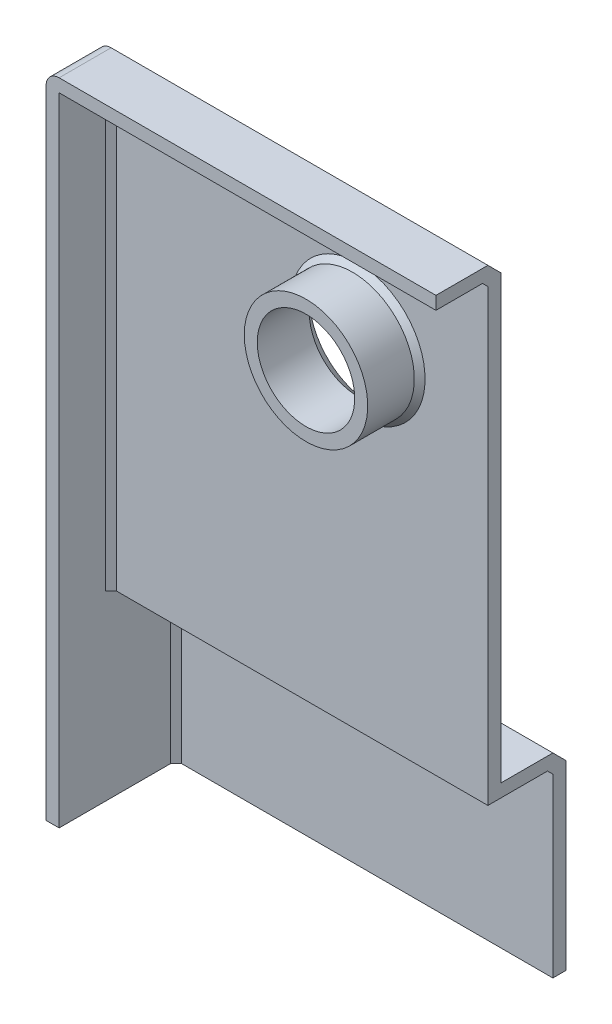
ISO-10303-21;
HEADER;
FILE_DESCRIPTION(('STEP AP214'),'2;1');
FILE_NAME('part.step','',(''),(''),'','','');
FILE_SCHEMA(('AUTOMOTIVE_DESIGN { 1 0 10303 214 1 1 1 1 }'));
ENDSEC;
DATA;
#1=APPLICATION_CONTEXT('core data for automotive mechanical design processes');
#2=APPLICATION_PROTOCOL_DEFINITION('international standard','automotive_design',2000,#1);
#3=PRODUCT_CONTEXT('',#1,'mechanical');
#4=PRODUCT('Part','Part','',(#3));
#5=PRODUCT_RELATED_PRODUCT_CATEGORY('part','',(#4));
#6=PRODUCT_DEFINITION_FORMATION('','',#4);
#7=PRODUCT_DEFINITION_CONTEXT('part definition',#1,'design');
#8=PRODUCT_DEFINITION('design','',#6,#7);
#9=PRODUCT_DEFINITION_SHAPE('','',#8);
#10=(LENGTH_UNIT() NAMED_UNIT(*) SI_UNIT(.MILLI.,.METRE.));
#11=(NAMED_UNIT(*) PLANE_ANGLE_UNIT() SI_UNIT($,.RADIAN.));
#12=(NAMED_UNIT(*) SI_UNIT($,.STERADIAN.) SOLID_ANGLE_UNIT());
#13=UNCERTAINTY_MEASURE_WITH_UNIT(LENGTH_MEASURE(1.E-05),#10,'distance_accuracy_value','');
#14=(GEOMETRIC_REPRESENTATION_CONTEXT(3) GLOBAL_UNCERTAINTY_ASSIGNED_CONTEXT((#13)) GLOBAL_UNIT_ASSIGNED_CONTEXT((#10,
#11,#12)) REPRESENTATION_CONTEXT('',''));
#15=CARTESIAN_POINT('',(0.,0.,0.));
#16=DIRECTION('',(0.,0.,1.));
#17=DIRECTION('',(1.,0.,0.));
#18=AXIS2_PLACEMENT_3D('',#15,#16,#17);
#19=CARTESIAN_POINT('',(0.,0.,12.7));
#20=DIRECTION('',(0.,1.,0.));
#21=DIRECTION('',(0.,0.,1.));
#22=AXIS2_PLACEMENT_3D('',#19,#20,#21);
#23=PLANE('',#22);
#24=DIRECTION('',(0.,0.,-1.));
#25=VECTOR('',#24,1.);
#26=CARTESIAN_POINT('',(2.54,0.,12.7));
#27=LINE('',#26,#25);
#28=CARTESIAN_POINT('',(2.54,0.,12.7));
#29=VERTEX_POINT('',#28);
#30=CARTESIAN_POINT('',(2.54,0.,-9.10789755157235));
#31=VERTEX_POINT('',#30);
#32=EDGE_CURVE('E220',#29,#31,#27,.T.);
#33=ORIENTED_EDGE('',*,*,#32,.F.);
#34=DIRECTION('',(1.,0.,0.));
#35=VECTOR('',#34,1.);
#36=CARTESIAN_POINT('',(0.,0.,12.7));
#37=LINE('',#36,#35);
#38=CARTESIAN_POINT('',(0.,0.,12.7));
#39=VERTEX_POINT('',#38);
#40=EDGE_CURVE('E286',#39,#29,#37,.T.);
#41=ORIENTED_EDGE('',*,*,#40,.F.);
#42=DIRECTION('',(0.,0.,-1.));
#43=VECTOR('',#42,1.);
#44=CARTESIAN_POINT('',(0.,0.,12.7));
#45=LINE('',#44,#43);
#46=CARTESIAN_POINT('',(0.,0.,-10.16));
#47=VERTEX_POINT('',#46);
#48=EDGE_CURVE('E307',#39,#47,#45,.T.);
#49=ORIENTED_EDGE('',*,*,#48,.T.);
#50=DIRECTION('',(-0.707106781186548,0.,0.707106781186548));
#51=VECTOR('',#50,1.);
#52=CARTESIAN_POINT('',(2.53999999999999,0.,-12.7));
#53=LINE('',#52,#51);
#54=CARTESIAN_POINT('',(2.54000000000001,0.,-12.7));
#55=VERTEX_POINT('',#54);
#56=EDGE_CURVE('E368',#47,#55,#53,.F.);
#57=ORIENTED_EDGE('',*,*,#56,.T.);
#58=DIRECTION('',(-1.,0.,0.));
#59=VECTOR('',#58,1.);
#60=CARTESIAN_POINT('',(76.2,0.,-12.7));
#61=LINE('',#60,#59);
#62=CARTESIAN_POINT('',(76.2,0.,-12.7));
#63=VERTEX_POINT('',#62);
#64=EDGE_CURVE('E272',#63,#55,#61,.T.);
#65=ORIENTED_EDGE('',*,*,#64,.F.);
#66=DIRECTION('',(0.,0.,-1.));
#67=VECTOR('',#66,1.);
#68=CARTESIAN_POINT('',(76.2,0.,12.7));
#69=LINE('',#68,#67);
#70=CARTESIAN_POINT('',(76.2,0.,-10.16));
#71=VERTEX_POINT('',#70);
#72=EDGE_CURVE('E304',#71,#63,#69,.T.);
#73=ORIENTED_EDGE('',*,*,#72,.F.);
#74=DIRECTION('',(-1.,0.,0.));
#75=VECTOR('',#74,1.);
#76=CARTESIAN_POINT('',(0.,0.,-10.16));
#77=LINE('',#76,#75);
#78=CARTESIAN_POINT('',(3.59210244842765,0.,-10.16));
#79=VERTEX_POINT('',#78);
#80=EDGE_CURVE('E228',#71,#79,#77,.T.);
#81=ORIENTED_EDGE('',*,*,#80,.T.);
#82=DIRECTION('',(-0.707106781186548,0.,0.707106781186548));
#83=VECTOR('',#82,1.);
#84=CARTESIAN_POINT('',(4.33605122421382,0.,-10.9039487757862));
#85=LINE('',#84,#83);
#86=EDGE_CURVE('E224',#31,#79,#85,.F.);
#87=ORIENTED_EDGE('',*,*,#86,.F.);
#88=EDGE_LOOP('',(#33,#41,#49,#57,#65,#73,#81,#87));
#89=FACE_BOUND('',#88,.T.);
#90=ADVANCED_FACE('F45',(#89),#23,.F.);
#91=CARTESIAN_POINT('',(0.,0.,12.7));
#92=DIRECTION('',(0.,0.,-1.));
#93=DIRECTION('',(-1.,0.,0.));
#94=AXIS2_PLACEMENT_3D('',#91,#92,#93);
#95=PLANE('',#94);
#96=CARTESIAN_POINT('',(50.8,101.6,12.7));
#97=DIRECTION('',(0.,0.,-1.));
#98=DIRECTION('',(-1.,0.,0.));
#99=AXIS2_PLACEMENT_3D('',#96,#97,#98);
#100=CIRCLE('',#99,9.525);
#101=CARTESIAN_POINT('',(41.275,101.6,12.7));
#102=VERTEX_POINT('',#101);
#103=EDGE_CURVE('E262',#102,#102,#100,.T.);
#104=ORIENTED_EDGE('',*,*,#103,.T.);
#105=EDGE_LOOP('',(#104));
#106=FACE_BOUND('',#105,.T.);
#107=CARTESIAN_POINT('',(50.8,101.6,12.7));
#108=DIRECTION('',(0.,0.,-1.));
#109=DIRECTION('',(-1.,0.,0.));
#110=AXIS2_PLACEMENT_3D('',#107,#108,#109);
#111=CIRCLE('',#110,12.065);
#112=CARTESIAN_POINT('',(38.735,101.6,12.7));
#113=VERTEX_POINT('',#112);
#114=EDGE_CURVE('E258',#113,#113,#111,.T.);
#115=ORIENTED_EDGE('',*,*,#114,.F.);
#116=EDGE_LOOP('',(#115));
#117=FACE_BOUND('',#116,.T.);
#118=ADVANCED_FACE('F459',(#106,#117),#95,.F.);
#119=DIRECTION('',(-1.,0.,0.));
#120=VECTOR('',#119,1.);
#121=CARTESIAN_POINT('',(0.,124.46,12.7));
#122=LINE('',#121,#120);
#123=CARTESIAN_POINT('',(76.2,124.46,12.7));
#124=VERTEX_POINT('',#123);
#125=CARTESIAN_POINT('',(2.54,124.46,12.7));
#126=VERTEX_POINT('',#125);
#127=EDGE_CURVE('E64',#124,#126,#122,.T.);
#128=ORIENTED_EDGE('',*,*,#127,.F.);
#129=DIRECTION('',(0.,1.,0.));
#130=VECTOR('',#129,1.);
#131=CARTESIAN_POINT('',(76.2,0.,12.7));
#132=LINE('',#131,#130);
#133=CARTESIAN_POINT('',(76.2,127.,12.7));
#134=VERTEX_POINT('',#133);
#135=EDGE_CURVE('E290',#124,#134,#132,.T.);
#136=ORIENTED_EDGE('',*,*,#135,.T.);
#137=DIRECTION('',(-1.,0.,0.));
#138=VECTOR('',#137,1.);
#139=CARTESIAN_POINT('',(0.,127.,12.7));
#140=LINE('',#139,#138);
#141=CARTESIAN_POINT('',(2.54,127.,12.7));
#142=VERTEX_POINT('',#141);
#143=EDGE_CURVE('E293',#134,#142,#140,.T.);
#144=ORIENTED_EDGE('',*,*,#143,.T.);
#145=CARTESIAN_POINT('',(2.54,124.46,12.7));
#146=DIRECTION('',(0.,0.,-1.));
#147=DIRECTION('',(-1.,0.,0.));
#148=AXIS2_PLACEMENT_3D('',#145,#146,#147);
#149=CIRCLE('',#148,2.54);
#150=CARTESIAN_POINT('',(0.,124.46,12.7));
#151=VERTEX_POINT('',#150);
#152=EDGE_CURVE('E325',#142,#151,#149,.F.);
#153=ORIENTED_EDGE('',*,*,#152,.T.);
#154=DIRECTION('',(0.,-1.,0.));
#155=VECTOR('',#154,1.);
#156=CARTESIAN_POINT('',(0.,0.,12.7));
#157=LINE('',#156,#155);
#158=EDGE_CURVE('E283',#151,#39,#157,.T.);
#159=ORIENTED_EDGE('',*,*,#158,.T.);
#160=ORIENTED_EDGE('',*,*,#40,.T.);
#161=DIRECTION('',(0.,-1.,0.));
#162=VECTOR('',#161,1.);
#163=CARTESIAN_POINT('',(2.54,0.,12.7));
#164=LINE('',#163,#162);
#165=EDGE_CURVE('E247',#126,#29,#164,.T.);
#166=ORIENTED_EDGE('',*,*,#165,.F.);
#167=EDGE_LOOP('',(#128,#136,#144,#153,#159,#160,#166));
#168=FACE_BOUND('',#167,.T.);
#169=ADVANCED_FACE('F440',(#168),#95,.F.);
#170=CARTESIAN_POINT('',(0.,0.,12.7));
#171=DIRECTION('',(1.,0.,0.));
#172=DIRECTION('',(0.,0.,-1.));
#173=AXIS2_PLACEMENT_3D('',#170,#171,#172);
#174=PLANE('',#173);
#175=DIRECTION('',(0.,0.,-1.));
#176=VECTOR('',#175,1.);
#177=CARTESIAN_POINT('',(0.,124.46,12.7));
#178=LINE('',#177,#176);
#179=CARTESIAN_POINT('',(0.,124.46,2.54000000000001));
#180=VERTEX_POINT('',#179);
#181=EDGE_CURVE('E314',#151,#180,#178,.T.);
#182=ORIENTED_EDGE('',*,*,#181,.T.);
#183=DIRECTION('',(0.,-1.,0.));
#184=VECTOR('',#183,1.);
#185=CARTESIAN_POINT('',(0.,35.56,2.54000000000001));
#186=LINE('',#185,#184);
#187=CARTESIAN_POINT('',(0.,35.56,2.54000000000001));
#188=VERTEX_POINT('',#187);
#189=EDGE_CURVE('E345',#180,#188,#186,.T.);
#190=ORIENTED_EDGE('',*,*,#189,.T.);
#191=DIRECTION('',(0.,0.,1.));
#192=VECTOR('',#191,1.);
#193=CARTESIAN_POINT('',(0.,35.56,12.7));
#194=LINE('',#193,#192);
#195=CARTESIAN_POINT('',(0.,35.56,-10.16));
#196=VERTEX_POINT('',#195);
#197=EDGE_CURVE('E318',#188,#196,#194,.F.);
#198=ORIENTED_EDGE('',*,*,#197,.T.);
#199=DIRECTION('',(0.,-1.,0.));
#200=VECTOR('',#199,1.);
#201=CARTESIAN_POINT('',(0.,0.,-10.16));
#202=LINE('',#201,#200);
#203=EDGE_CURVE('E342',#196,#47,#202,.T.);
#204=ORIENTED_EDGE('',*,*,#203,.T.);
#205=ORIENTED_EDGE('',*,*,#48,.F.);
#206=ORIENTED_EDGE('',*,*,#158,.F.);
#207=EDGE_LOOP('',(#182,#190,#198,#204,#205,#206));
#208=FACE_BOUND('',#207,.T.);
#209=ADVANCED_FACE('F409',(#208),#174,.F.);
#210=CARTESIAN_POINT('',(76.2,0.,12.7));
#211=DIRECTION('',(-1.,0.,0.));
#212=DIRECTION('',(0.,0.,1.));
#213=AXIS2_PLACEMENT_3D('',#210,#211,#212);
#214=PLANE('',#213);
#215=ORIENTED_EDGE('',*,*,#135,.F.);
#216=DIRECTION('',(0.,0.,-1.));
#217=VECTOR('',#216,1.);
#218=CARTESIAN_POINT('',(76.2,124.46,12.7));
#219=LINE('',#218,#217);
#220=CARTESIAN_POINT('',(76.2,124.46,3.59210244842768));
#221=VERTEX_POINT('',#220);
#222=EDGE_CURVE('E223',#124,#221,#219,.T.);
#223=ORIENTED_EDGE('',*,*,#222,.T.);
#224=DIRECTION('',(0.,0.707106781186548,0.707106781186548));
#225=VECTOR('',#224,1.);
#226=CARTESIAN_POINT('',(76.2,125.203948775786,4.33605122421385));
#227=LINE('',#226,#225);
#228=CARTESIAN_POINT('',(76.2,123.407897551572,2.54));
#229=VERTEX_POINT('',#228);
#230=EDGE_CURVE('E240',#229,#221,#227,.T.);
#231=ORIENTED_EDGE('',*,*,#230,.F.);
#232=DIRECTION('',(0.,1.,0.));
#233=VECTOR('',#232,1.);
#234=CARTESIAN_POINT('',(76.2,0.,2.54));
#235=LINE('',#234,#233);
#236=CARTESIAN_POINT('',(76.2,35.56,2.54));
#237=VERTEX_POINT('',#236);
#238=EDGE_CURVE('E243',#237,#229,#235,.T.);
#239=ORIENTED_EDGE('',*,*,#238,.F.);
#240=DIRECTION('',(0.,0.,1.));
#241=VECTOR('',#240,1.);
#242=CARTESIAN_POINT('',(76.2,35.56,12.7));
#243=LINE('',#242,#241);
#244=CARTESIAN_POINT('',(76.2,35.56,-9.10789755157235));
#245=VERTEX_POINT('',#244);
#246=EDGE_CURVE('E232',#245,#237,#243,.T.);
#247=ORIENTED_EDGE('',*,*,#246,.F.);
#248=DIRECTION('',(0.,-0.707106781186548,-0.707106781186548));
#249=VECTOR('',#248,1.);
#250=CARTESIAN_POINT('',(76.2,33.7639487757862,-10.9039487757862));
#251=LINE('',#250,#249);
#252=CARTESIAN_POINT('',(76.2,34.5078975515724,-10.16));
#253=VERTEX_POINT('',#252);
#254=EDGE_CURVE('E237',#253,#245,#251,.F.);
#255=ORIENTED_EDGE('',*,*,#254,.F.);
#256=DIRECTION('',(0.,-1.,0.));
#257=VECTOR('',#256,1.);
#258=CARTESIAN_POINT('',(76.2,0.,-10.16));
#259=LINE('',#258,#257);
#260=EDGE_CURVE('E233',#253,#71,#259,.T.);
#261=ORIENTED_EDGE('',*,*,#260,.T.);
#262=ORIENTED_EDGE('',*,*,#72,.T.);
#263=DIRECTION('',(0.,-1.,0.));
#264=VECTOR('',#263,1.);
#265=CARTESIAN_POINT('',(76.2,0.,-12.7));
#266=LINE('',#265,#264);
#267=CARTESIAN_POINT('',(76.2,35.56,-12.7));
#268=VERTEX_POINT('',#267);
#269=EDGE_CURVE('E268',#268,#63,#266,.T.);
#270=ORIENTED_EDGE('',*,*,#269,.F.);
#271=DIRECTION('',(0.,-0.707106781186548,-0.707106781186548));
#272=VECTOR('',#271,1.);
#273=CARTESIAN_POINT('',(76.2,35.56,-12.7));
#274=LINE('',#273,#272);
#275=CARTESIAN_POINT('',(76.2,38.1,-10.16));
#276=VERTEX_POINT('',#275);
#277=EDGE_CURVE('E355',#268,#276,#274,.F.);
#278=ORIENTED_EDGE('',*,*,#277,.T.);
#279=DIRECTION('',(0.,0.,1.));
#280=VECTOR('',#279,1.);
#281=CARTESIAN_POINT('',(76.2,38.1,-12.7));
#282=LINE('',#281,#280);
#283=CARTESIAN_POINT('',(76.2,38.1,0.));
#284=VERTEX_POINT('',#283);
#285=EDGE_CURVE('E276',#276,#284,#282,.T.);
#286=ORIENTED_EDGE('',*,*,#285,.T.);
#287=DIRECTION('',(0.,1.,0.));
#288=VECTOR('',#287,1.);
#289=CARTESIAN_POINT('',(76.2,0.,0.));
#290=LINE('',#289,#288);
#291=CARTESIAN_POINT('',(76.2,124.46,0.));
#292=VERTEX_POINT('',#291);
#293=EDGE_CURVE('E282',#284,#292,#290,.T.);
#294=ORIENTED_EDGE('',*,*,#293,.T.);
#295=DIRECTION('',(0.,0.707106781186548,0.707106781186548));
#296=VECTOR('',#295,1.);
#297=CARTESIAN_POINT('',(76.2,127.,2.54000000000001));
#298=LINE('',#297,#296);
#299=CARTESIAN_POINT('',(76.2,127.,2.54000000000001));
#300=VERTEX_POINT('',#299);
#301=EDGE_CURVE('E358',#292,#300,#298,.T.);
#302=ORIENTED_EDGE('',*,*,#301,.T.);
#303=DIRECTION('',(0.,0.,-1.));
#304=VECTOR('',#303,1.);
#305=CARTESIAN_POINT('',(76.2,127.,12.7));
#306=LINE('',#305,#304);
#307=EDGE_CURVE('E297',#134,#300,#306,.T.);
#308=ORIENTED_EDGE('',*,*,#307,.F.);
#309=EDGE_LOOP('',(#215,#223,#231,#239,#247,#255,#261,#262,#270,#278,#286,#294,#302,#308));
#310=FACE_BOUND('',#309,.T.);
#311=ADVANCED_FACE('F445',(#310),#214,.F.);
#312=CARTESIAN_POINT('',(0.,127.,12.7));
#313=DIRECTION('',(0.,-1.,0.));
#314=DIRECTION('',(0.,0.,-1.));
#315=AXIS2_PLACEMENT_3D('',#312,#313,#314);
#316=PLANE('',#315);
#317=ORIENTED_EDGE('',*,*,#307,.T.);
#318=DIRECTION('',(-1.,0.,0.));
#319=VECTOR('',#318,1.);
#320=CARTESIAN_POINT('',(2.54,127.,2.54000000000001));
#321=LINE('',#320,#319);
#322=CARTESIAN_POINT('',(2.54,127.,2.54000000000001));
#323=VERTEX_POINT('',#322);
#324=EDGE_CURVE('E352',#300,#323,#321,.T.);
#325=ORIENTED_EDGE('',*,*,#324,.T.);
#326=DIRECTION('',(0.,0.,-1.));
#327=VECTOR('',#326,1.);
#328=CARTESIAN_POINT('',(2.54,127.,12.7));
#329=LINE('',#328,#327);
#330=EDGE_CURVE('E322',#323,#142,#329,.F.);
#331=ORIENTED_EDGE('',*,*,#330,.T.);
#332=ORIENTED_EDGE('',*,*,#143,.F.);
#333=EDGE_LOOP('',(#317,#325,#331,#332));
#334=FACE_BOUND('',#333,.T.);
#335=ADVANCED_FACE('F438',(#334),#316,.F.);
#336=CARTESIAN_POINT('',(0.,0.,0.));
#337=DIRECTION('',(0.,0.,-1.));
#338=DIRECTION('',(-1.,0.,0.));
#339=AXIS2_PLACEMENT_3D('',#336,#337,#338);
#340=PLANE('',#339);
#341=CARTESIAN_POINT('',(50.8,101.6,0.));
#342=DIRECTION('',(0.,0.,-1.));
#343=DIRECTION('',(-1.,0.,0.));
#344=AXIS2_PLACEMENT_3D('',#341,#342,#343);
#345=CIRCLE('',#344,12.065);
#346=CARTESIAN_POINT('',(38.735,101.6,0.));
#347=VERTEX_POINT('',#346);
#348=EDGE_CURVE('E338',#347,#347,#345,.F.);
#349=ORIENTED_EDGE('',*,*,#348,.T.);
#350=EDGE_LOOP('',(#349));
#351=FACE_BOUND('',#350,.T.);
#352=DIRECTION('',(1.,0.,0.));
#353=VECTOR('',#352,1.);
#354=CARTESIAN_POINT('',(76.2,38.1,0.));
#355=LINE('',#354,#353);
#356=CARTESIAN_POINT('',(2.54000000000003,38.1,0.));
#357=VERTEX_POINT('',#356);
#358=EDGE_CURVE('E266',#357,#284,#355,.T.);
#359=ORIENTED_EDGE('',*,*,#358,.F.);
#360=DIRECTION('',(0.,1.,0.));
#361=VECTOR('',#360,1.);
#362=CARTESIAN_POINT('',(2.54000000000001,124.46,0.));
#363=LINE('',#362,#361);
#364=CARTESIAN_POINT('',(2.54,124.46,0.));
#365=VERTEX_POINT('',#364);
#366=EDGE_CURVE('E335',#357,#365,#363,.T.);
#367=ORIENTED_EDGE('',*,*,#366,.T.);
#368=DIRECTION('',(1.,0.,0.));
#369=VECTOR('',#368,1.);
#370=CARTESIAN_POINT('',(76.2,124.46,0.));
#371=LINE('',#370,#369);
#372=EDGE_CURVE('E332',#365,#292,#371,.T.);
#373=ORIENTED_EDGE('',*,*,#372,.T.);
#374=ORIENTED_EDGE('',*,*,#293,.F.);
#375=EDGE_LOOP('',(#359,#367,#373,#374));
#376=FACE_BOUND('',#375,.T.);
#377=ADVANCED_FACE('F422',(#351,#376),#340,.T.);
#378=CARTESIAN_POINT('',(76.2,38.1,-12.7));
#379=DIRECTION('',(0.,-1.,0.));
#380=DIRECTION('',(0.,0.,-1.));
#381=AXIS2_PLACEMENT_3D('',#378,#379,#380);
#382=PLANE('',#381);
#383=ORIENTED_EDGE('',*,*,#285,.F.);
#384=DIRECTION('',(-1.,0.,0.));
#385=VECTOR('',#384,1.);
#386=CARTESIAN_POINT('',(76.2,38.1,-10.16));
#387=LINE('',#386,#385);
#388=CARTESIAN_POINT('',(2.54,38.1,-10.16));
#389=VERTEX_POINT('',#388);
#390=EDGE_CURVE('E56',#276,#389,#387,.T.);
#391=ORIENTED_EDGE('',*,*,#390,.T.);
#392=DIRECTION('',(0.,0.,1.));
#393=VECTOR('',#392,1.);
#394=CARTESIAN_POINT('',(2.54,38.1,-12.7));
#395=LINE('',#394,#393);
#396=EDGE_CURVE('E311',#389,#357,#395,.T.);
#397=ORIENTED_EDGE('',*,*,#396,.T.);
#398=ORIENTED_EDGE('',*,*,#358,.T.);
#399=EDGE_LOOP('',(#383,#391,#397,#398));
#400=FACE_BOUND('',#399,.T.);
#401=ADVANCED_FACE('F446',(#400),#382,.F.);
#402=CARTESIAN_POINT('',(0.,0.,-12.7));
#403=DIRECTION('',(0.,0.,1.));
#404=DIRECTION('',(1.,0.,0.));
#405=AXIS2_PLACEMENT_3D('',#402,#403,#404);
#406=PLANE('',#405);
#407=ORIENTED_EDGE('',*,*,#64,.T.);
#408=DIRECTION('',(0.,1.,0.));
#409=VECTOR('',#408,1.);
#410=CARTESIAN_POINT('',(2.53999999999999,0.,-12.7));
#411=LINE('',#410,#409);
#412=CARTESIAN_POINT('',(2.54,35.56,-12.7));
#413=VERTEX_POINT('',#412);
#414=EDGE_CURVE('E364',#55,#413,#411,.T.);
#415=ORIENTED_EDGE('',*,*,#414,.T.);
#416=DIRECTION('',(1.,0.,0.));
#417=VECTOR('',#416,1.);
#418=CARTESIAN_POINT('',(0.,35.56,-12.7));
#419=LINE('',#418,#417);
#420=EDGE_CURVE('E361',#413,#268,#419,.T.);
#421=ORIENTED_EDGE('',*,*,#420,.T.);
#422=ORIENTED_EDGE('',*,*,#269,.T.);
#423=EDGE_LOOP('',(#407,#415,#421,#422));
#424=FACE_BOUND('',#423,.T.);
#425=ADVANCED_FACE('F398',(#424),#406,.F.);
#426=CARTESIAN_POINT('',(50.8,101.6,12.7));
#427=DIRECTION('',(0.,0.,-1.));
#428=DIRECTION('',(-1.,0.,0.));
#429=AXIS2_PLACEMENT_3D('',#426,#427,#428);
#430=CYLINDRICAL_SURFACE('',#429,9.525);
#431=CARTESIAN_POINT('',(50.8,101.6,2.54000000000001));
#432=DIRECTION('',(0.,0.,-1.));
#433=DIRECTION('',(-1.,0.,0.));
#434=AXIS2_PLACEMENT_3D('',#431,#432,#433);
#435=CIRCLE('',#434,9.525);
#436=CARTESIAN_POINT('',(41.275,101.6,2.54000000000001));
#437=VERTEX_POINT('',#436);
#438=EDGE_CURVE('E328',#437,#437,#435,.T.);
#439=ORIENTED_EDGE('',*,*,#438,.T.);
#440=EDGE_LOOP('',(#439));
#441=FACE_BOUND('',#440,.T.);
#442=ORIENTED_EDGE('',*,*,#103,.F.);
#443=EDGE_LOOP('',(#442));
#444=FACE_BOUND('',#443,.T.);
#445=ADVANCED_FACE('F453',(#441,#444),#430,.F.);
#446=CARTESIAN_POINT('',(2.54,35.56,-12.7));
#447=DIRECTION('',(0.,0.,1.));
#448=DIRECTION('',(1.,0.,0.));
#449=AXIS2_PLACEMENT_3D('',#446,#447,#448);
#450=CYLINDRICAL_SURFACE('',#449,2.54);
#451=ORIENTED_EDGE('',*,*,#396,.F.);
#452=CARTESIAN_POINT('',(2.54,35.56,-10.16));
#453=DIRECTION('',(0.,0.,1.));
#454=DIRECTION('',(1.,0.,0.));
#455=AXIS2_PLACEMENT_3D('',#452,#453,#454);
#456=CIRCLE('',#455,2.54);
#457=EDGE_CURVE('E371',#389,#196,#456,.T.);
#458=ORIENTED_EDGE('',*,*,#457,.T.);
#459=ORIENTED_EDGE('',*,*,#197,.F.);
#460=CARTESIAN_POINT('',(2.54,35.56,0.));
#461=DIRECTION('',(-0.707106781186547,0.,-0.707106781186547));
#462=DIRECTION('',(-0.707106781186548,0.,0.707106781186548));
#463=AXIS2_PLACEMENT_3D('',#460,#461,#462);
#464=ELLIPSE('',#463,3.59210244842766,2.54);
#465=EDGE_CURVE('E11',#188,#357,#464,.T.);
#466=ORIENTED_EDGE('',*,*,#465,.T.);
#467=EDGE_LOOP('',(#451,#458,#459,#466));
#468=FACE_BOUND('',#467,.T.);
#469=ADVANCED_FACE('F414',(#468),#450,.T.);
#470=CARTESIAN_POINT('',(2.54,124.46,12.7));
#471=DIRECTION('',(0.,0.,-1.));
#472=DIRECTION('',(-1.,0.,0.));
#473=AXIS2_PLACEMENT_3D('',#470,#471,#472);
#474=CYLINDRICAL_SURFACE('',#473,2.54);
#475=ORIENTED_EDGE('',*,*,#330,.F.);
#476=CARTESIAN_POINT('',(2.54,124.46,2.54000000000001));
#477=DIRECTION('',(0.,0.,-1.));
#478=DIRECTION('',(-1.,0.,0.));
#479=AXIS2_PLACEMENT_3D('',#476,#477,#478);
#480=CIRCLE('',#479,2.54);
#481=EDGE_CURVE('E349',#323,#180,#480,.F.);
#482=ORIENTED_EDGE('',*,*,#481,.T.);
#483=ORIENTED_EDGE('',*,*,#181,.F.);
#484=ORIENTED_EDGE('',*,*,#152,.F.);
#485=EDGE_LOOP('',(#475,#482,#483,#484));
#486=FACE_BOUND('',#485,.T.);
#487=ADVANCED_FACE('F434',(#486),#474,.T.);
#488=CARTESIAN_POINT('',(50.8,101.6,2.54000000000001));
#489=DIRECTION('',(0.,0.,-1.));
#490=DIRECTION('',(-1.,0.,0.));
#491=AXIS2_PLACEMENT_3D('',#488,#489,#490);
#492=CONICAL_SURFACE('',#491,9.525,0.785398163397446);
#493=ORIENTED_EDGE('',*,*,#348,.F.);
#494=EDGE_LOOP('',(#493));
#495=FACE_BOUND('',#494,.T.);
#496=ORIENTED_EDGE('',*,*,#438,.F.);
#497=EDGE_LOOP('',(#496));
#498=FACE_BOUND('',#497,.T.);
#499=ADVANCED_FACE('F474',(#495,#498),#492,.F.);
#500=CARTESIAN_POINT('',(0.,127.,2.54000000000001));
#501=DIRECTION('',(0.,0.707106781186547,-0.707106781186547));
#502=DIRECTION('',(1.,0.,0.));
#503=AXIS2_PLACEMENT_3D('',#500,#501,#502);
#504=PLANE('',#503);
#505=DIRECTION('',(0.,-0.707106781186547,-0.707106781186547));
#506=VECTOR('',#505,1.);
#507=CARTESIAN_POINT('',(2.54,127.,2.54000000000001));
#508=LINE('',#507,#506);
#509=EDGE_CURVE('E267',#323,#365,#508,.T.);
#510=ORIENTED_EDGE('',*,*,#509,.F.);
#511=ORIENTED_EDGE('',*,*,#324,.F.);
#512=ORIENTED_EDGE('',*,*,#301,.F.);
#513=ORIENTED_EDGE('',*,*,#372,.F.);
#514=EDGE_LOOP('',(#510,#511,#512,#513));
#515=FACE_BOUND('',#514,.T.);
#516=ADVANCED_FACE('F427',(#515),#504,.T.);
#517=CARTESIAN_POINT('',(2.54,124.46,2.54000000000001));
#518=DIRECTION('',(0.,0.,1.));
#519=DIRECTION('',(1.,0.,0.));
#520=AXIS2_PLACEMENT_3D('',#517,#518,#519);
#521=CONICAL_SURFACE('',#520,2.54000000000001,0.785398163397448);
#522=ORIENTED_EDGE('',*,*,#481,.F.);
#523=ORIENTED_EDGE('',*,*,#509,.T.);
#524=DIRECTION('',(0.707106781186547,0.,-0.707106781186547));
#525=VECTOR('',#524,1.);
#526=CARTESIAN_POINT('',(0.,124.46,2.54000000000001));
#527=LINE('',#526,#525);
#528=EDGE_CURVE('E376',#180,#365,#527,.T.);
#529=ORIENTED_EDGE('',*,*,#528,.F.);
#530=EDGE_LOOP('',(#522,#523,#529));
#531=FACE_BOUND('',#530,.T.);
#532=ADVANCED_FACE('F431',(#531),#521,.T.);
#533=CARTESIAN_POINT('',(0.,0.,2.54000000000001));
#534=DIRECTION('',(-0.707106781186547,0.,-0.707106781186547));
#535=DIRECTION('',(0.,1.,0.));
#536=AXIS2_PLACEMENT_3D('',#533,#534,#535);
#537=PLANE('',#536);
#538=ORIENTED_EDGE('',*,*,#528,.T.);
#539=ORIENTED_EDGE('',*,*,#366,.F.);
#540=ORIENTED_EDGE('',*,*,#465,.F.);
#541=ORIENTED_EDGE('',*,*,#189,.F.);
#542=EDGE_LOOP('',(#538,#539,#540,#541));
#543=FACE_BOUND('',#542,.T.);
#544=ADVANCED_FACE('F417',(#543),#537,.T.);
#545=CARTESIAN_POINT('',(0.,35.56,-12.7));
#546=DIRECTION('',(0.,-0.707106781186548,0.707106781186548));
#547=DIRECTION('',(1.,0.,0.));
#548=AXIS2_PLACEMENT_3D('',#545,#546,#547);
#549=PLANE('',#548);
#550=DIRECTION('',(0.,-0.707106781186548,-0.707106781186548));
#551=VECTOR('',#550,1.);
#552=CARTESIAN_POINT('',(2.54,38.1,-10.16));
#553=LINE('',#552,#551);
#554=EDGE_CURVE('E50',#389,#413,#553,.T.);
#555=ORIENTED_EDGE('',*,*,#554,.F.);
#556=ORIENTED_EDGE('',*,*,#390,.F.);
#557=ORIENTED_EDGE('',*,*,#277,.F.);
#558=ORIENTED_EDGE('',*,*,#420,.F.);
#559=EDGE_LOOP('',(#555,#556,#557,#558));
#560=FACE_BOUND('',#559,.T.);
#561=ADVANCED_FACE('F48',(#560),#549,.F.);
#562=CARTESIAN_POINT('',(2.54,35.56,-10.16));
#563=DIRECTION('',(0.,0.,1.));
#564=DIRECTION('',(1.,0.,0.));
#565=AXIS2_PLACEMENT_3D('',#562,#563,#564);
#566=CONICAL_SURFACE('',#565,2.53999999999999,0.785398163397448);
#567=ORIENTED_EDGE('',*,*,#457,.F.);
#568=ORIENTED_EDGE('',*,*,#554,.T.);
#569=DIRECTION('',(0.707106781186547,0.,-0.707106781186548));
#570=VECTOR('',#569,1.);
#571=CARTESIAN_POINT('',(0.,35.56,-10.16));
#572=LINE('',#571,#570);
#573=EDGE_CURVE('E214',#196,#413,#572,.T.);
#574=ORIENTED_EDGE('',*,*,#573,.F.);
#575=EDGE_LOOP('',(#567,#568,#574));
#576=FACE_BOUND('',#575,.T.);
#577=ADVANCED_FACE('F393',(#576),#566,.T.);
#578=CARTESIAN_POINT('',(2.53999999999999,0.,-12.7));
#579=DIRECTION('',(0.707106781186548,0.,0.707106781186548));
#580=DIRECTION('',(0.,1.,0.));
#581=AXIS2_PLACEMENT_3D('',#578,#579,#580);
#582=PLANE('',#581);
#583=ORIENTED_EDGE('',*,*,#56,.F.);
#584=ORIENTED_EDGE('',*,*,#203,.F.);
#585=ORIENTED_EDGE('',*,*,#573,.T.);
#586=ORIENTED_EDGE('',*,*,#414,.F.);
#587=EDGE_LOOP('',(#583,#584,#585,#586));
#588=FACE_BOUND('',#587,.T.);
#589=ADVANCED_FACE('F401',(#588),#582,.F.);
#590=CARTESIAN_POINT('',(2.54,0.,12.7));
#591=DIRECTION('',(1.,0.,0.));
#592=DIRECTION('',(0.,0.,-1.));
#593=AXIS2_PLACEMENT_3D('',#590,#591,#592);
#594=PLANE('',#593);
#595=DIRECTION('',(0.,0.,-1.));
#596=VECTOR('',#595,1.);
#597=CARTESIAN_POINT('',(2.54,124.46,12.7));
#598=LINE('',#597,#596);
#599=CARTESIAN_POINT('',(2.54,124.46,3.59210244842768));
#600=VERTEX_POINT('',#599);
#601=EDGE_CURVE('E192',#126,#600,#598,.T.);
#602=ORIENTED_EDGE('',*,*,#601,.F.);
#603=ORIENTED_EDGE('',*,*,#165,.T.);
#604=ORIENTED_EDGE('',*,*,#32,.T.);
#605=DIRECTION('',(0.,1.,0.));
#606=VECTOR('',#605,1.);
#607=CARTESIAN_POINT('',(2.54,0.,-9.10789755157235));
#608=LINE('',#607,#606);
#609=CARTESIAN_POINT('',(2.54,35.56,-9.10789755157235));
#610=VERTEX_POINT('',#609);
#611=EDGE_CURVE('E185',#610,#31,#608,.F.);
#612=ORIENTED_EDGE('',*,*,#611,.F.);
#613=DIRECTION('',(0.,0.,-1.));
#614=VECTOR('',#613,1.);
#615=CARTESIAN_POINT('',(2.54,35.56,12.7));
#616=LINE('',#615,#614);
#617=CARTESIAN_POINT('',(2.54,35.56,3.59210244842768));
#618=VERTEX_POINT('',#617);
#619=EDGE_CURVE('E179',#618,#610,#616,.T.);
#620=ORIENTED_EDGE('',*,*,#619,.F.);
#621=DIRECTION('',(0.,-1.,0.));
#622=VECTOR('',#621,1.);
#623=CARTESIAN_POINT('',(2.54,0.,3.59210244842768));
#624=LINE('',#623,#622);
#625=EDGE_CURVE('E182',#600,#618,#624,.T.);
#626=ORIENTED_EDGE('',*,*,#625,.F.);
#627=EDGE_LOOP('',(#602,#603,#604,#612,#620,#626));
#628=FACE_BOUND('',#627,.T.);
#629=ADVANCED_FACE('F181',(#628),#594,.T.);
#630=CARTESIAN_POINT('',(0.,124.46,12.7));
#631=DIRECTION('',(0.,-1.,0.));
#632=DIRECTION('',(0.,0.,-1.));
#633=AXIS2_PLACEMENT_3D('',#630,#631,#632);
#634=PLANE('',#633);
#635=ORIENTED_EDGE('',*,*,#222,.F.);
#636=ORIENTED_EDGE('',*,*,#127,.T.);
#637=ORIENTED_EDGE('',*,*,#601,.T.);
#638=DIRECTION('',(-1.,0.,0.));
#639=VECTOR('',#638,1.);
#640=CARTESIAN_POINT('',(0.,124.46,3.59210244842768));
#641=LINE('',#640,#639);
#642=EDGE_CURVE('E202',#221,#600,#641,.T.);
#643=ORIENTED_EDGE('',*,*,#642,.F.);
#644=EDGE_LOOP('',(#635,#636,#637,#643));
#645=FACE_BOUND('',#644,.T.);
#646=ADVANCED_FACE('F595',(#645),#634,.T.);
#647=CARTESIAN_POINT('',(0.,0.,2.54));
#648=DIRECTION('',(0.,0.,-1.));
#649=DIRECTION('',(-1.,0.,0.));
#650=AXIS2_PLACEMENT_3D('',#647,#648,#649);
#651=PLANE('',#650);
#652=CARTESIAN_POINT('',(50.8,101.6,2.54));
#653=DIRECTION('',(0.,0.,-1.));
#654=DIRECTION('',(-1.,0.,0.));
#655=AXIS2_PLACEMENT_3D('',#652,#653,#654);
#656=CIRCLE('',#655,13.1171024484277);
#657=CARTESIAN_POINT('',(37.6828975515723,101.6,2.54));
#658=VERTEX_POINT('',#657);
#659=EDGE_CURVE('E826',#658,#658,#656,.F.);
#660=ORIENTED_EDGE('',*,*,#659,.F.);
#661=EDGE_LOOP('',(#660));
#662=FACE_BOUND('',#661,.T.);
#663=DIRECTION('',(1.,0.,0.));
#664=VECTOR('',#663,1.);
#665=CARTESIAN_POINT('',(76.2,35.56,2.54));
#666=LINE('',#665,#664);
#667=CARTESIAN_POINT('',(3.59210244842768,35.56,2.54));
#668=VERTEX_POINT('',#667);
#669=EDGE_CURVE('E207',#668,#237,#666,.T.);
#670=ORIENTED_EDGE('',*,*,#669,.T.);
#671=ORIENTED_EDGE('',*,*,#238,.T.);
#672=DIRECTION('',(1.,0.,0.));
#673=VECTOR('',#672,1.);
#674=CARTESIAN_POINT('',(0.,123.407897551572,2.54));
#675=LINE('',#674,#673);
#676=CARTESIAN_POINT('',(3.59210244842768,123.407897551572,2.54));
#677=VERTEX_POINT('',#676);
#678=EDGE_CURVE('E820',#677,#229,#675,.T.);
#679=ORIENTED_EDGE('',*,*,#678,.F.);
#680=DIRECTION('',(0.,1.,0.));
#681=VECTOR('',#680,1.);
#682=CARTESIAN_POINT('',(3.59210244842768,0.,2.54));
#683=LINE('',#682,#681);
#684=EDGE_CURVE('E815',#668,#677,#683,.T.);
#685=ORIENTED_EDGE('',*,*,#684,.F.);
#686=EDGE_LOOP('',(#670,#671,#679,#685));
#687=FACE_BOUND('',#686,.T.);
#688=ADVANCED_FACE('F605',(#662,#687),#651,.F.);
#689=CARTESIAN_POINT('',(76.2,35.56,-12.7));
#690=DIRECTION('',(0.,-1.,0.));
#691=DIRECTION('',(0.,0.,-1.));
#692=AXIS2_PLACEMENT_3D('',#689,#690,#691);
#693=PLANE('',#692);
#694=ORIENTED_EDGE('',*,*,#246,.T.);
#695=ORIENTED_EDGE('',*,*,#669,.F.);
#696=DIRECTION('',(-0.707106781186548,0.,0.707106781186548));
#697=VECTOR('',#696,1.);
#698=CARTESIAN_POINT('',(1.79605122421383,35.56,4.33605122421385));
#699=LINE('',#698,#697);
#700=EDGE_CURVE('E197',#668,#618,#699,.T.);
#701=ORIENTED_EDGE('',*,*,#700,.T.);
#702=ORIENTED_EDGE('',*,*,#619,.T.);
#703=DIRECTION('',(1.,0.,0.));
#704=VECTOR('',#703,1.);
#705=CARTESIAN_POINT('',(0.,35.56,-9.10789755157235));
#706=LINE('',#705,#704);
#707=EDGE_CURVE('E216',#245,#610,#706,.F.);
#708=ORIENTED_EDGE('',*,*,#707,.F.);
#709=EDGE_LOOP('',(#694,#695,#701,#702,#708));
#710=FACE_BOUND('',#709,.T.);
#711=ADVANCED_FACE('F205',(#710),#693,.T.);
#712=CARTESIAN_POINT('',(0.,0.,-10.16));
#713=DIRECTION('',(0.,0.,1.));
#714=DIRECTION('',(1.,0.,0.));
#715=AXIS2_PLACEMENT_3D('',#712,#713,#714);
#716=PLANE('',#715);
#717=ORIENTED_EDGE('',*,*,#80,.F.);
#718=ORIENTED_EDGE('',*,*,#260,.F.);
#719=DIRECTION('',(-1.,0.,0.));
#720=VECTOR('',#719,1.);
#721=CARTESIAN_POINT('',(0.,34.5078975515724,-10.16));
#722=LINE('',#721,#720);
#723=CARTESIAN_POINT('',(3.59210244842765,34.5078975515724,-10.16));
#724=VERTEX_POINT('',#723);
#725=EDGE_CURVE('E250',#724,#253,#722,.F.);
#726=ORIENTED_EDGE('',*,*,#725,.F.);
#727=DIRECTION('',(0.,-1.,0.));
#728=VECTOR('',#727,1.);
#729=CARTESIAN_POINT('',(3.59210244842765,0.,-10.16));
#730=LINE('',#729,#728);
#731=EDGE_CURVE('E227',#79,#724,#730,.F.);
#732=ORIENTED_EDGE('',*,*,#731,.F.);
#733=EDGE_LOOP('',(#717,#718,#726,#732));
#734=FACE_BOUND('',#733,.T.);
#735=ADVANCED_FACE('F625',(#734),#716,.T.);
#736=CARTESIAN_POINT('',(50.8,101.6,12.7));
#737=DIRECTION('',(0.,0.,-1.));
#738=DIRECTION('',(-1.,0.,0.));
#739=AXIS2_PLACEMENT_3D('',#736,#737,#738);
#740=CYLINDRICAL_SURFACE('',#739,12.065);
#741=CARTESIAN_POINT('',(50.8,101.6,3.59210244842767));
#742=DIRECTION('',(0.,0.,-1.));
#743=DIRECTION('',(-1.,0.,0.));
#744=AXIS2_PLACEMENT_3D('',#741,#742,#743);
#745=CIRCLE('',#744,12.065);
#746=CARTESIAN_POINT('',(38.735,101.6,3.59210244842767));
#747=VERTEX_POINT('',#746);
#748=EDGE_CURVE('E191',#747,#747,#745,.T.);
#749=ORIENTED_EDGE('',*,*,#748,.F.);
#750=EDGE_LOOP('',(#749));
#751=FACE_BOUND('',#750,.T.);
#752=ORIENTED_EDGE('',*,*,#114,.T.);
#753=EDGE_LOOP('',(#752));
#754=FACE_BOUND('',#753,.T.);
#755=ADVANCED_FACE('F635',(#751,#754),#740,.T.);
#756=CARTESIAN_POINT('',(50.8,101.6,4.33605122421384));
#757=DIRECTION('',(0.,0.,-1.));
#758=DIRECTION('',(-1.,0.,0.));
#759=AXIS2_PLACEMENT_3D('',#756,#757,#758);
#760=CONICAL_SURFACE('',#759,11.3210512242138,0.785398163397446);
#761=ORIENTED_EDGE('',*,*,#659,.T.);
#762=EDGE_LOOP('',(#761));
#763=FACE_BOUND('',#762,.T.);
#764=ORIENTED_EDGE('',*,*,#748,.T.);
#765=EDGE_LOOP('',(#764));
#766=FACE_BOUND('',#765,.T.);
#767=ADVANCED_FACE('F646',(#763,#766),#760,.T.);
#768=CARTESIAN_POINT('',(0.,125.203948775786,4.33605122421385));
#769=DIRECTION('',(0.,0.707106781186547,-0.707106781186547));
#770=DIRECTION('',(1.,0.,0.));
#771=AXIS2_PLACEMENT_3D('',#768,#769,#770);
#772=PLANE('',#771);
#773=DIRECTION('',(0.577350269189626,-0.577350269189626,-0.577350269189626));
#774=VECTOR('',#773,1.);
#775=CARTESIAN_POINT('',(43.5307008161426,83.4692991838575,-37.3985983677149));
#776=LINE('',#775,#774);
#777=EDGE_CURVE('E200',#600,#677,#776,.T.);
#778=ORIENTED_EDGE('',*,*,#777,.T.);
#779=ORIENTED_EDGE('',*,*,#678,.T.);
#780=ORIENTED_EDGE('',*,*,#230,.T.);
#781=ORIENTED_EDGE('',*,*,#642,.T.);
#782=EDGE_LOOP('',(#778,#779,#780,#781));
#783=FACE_BOUND('',#782,.T.);
#784=ADVANCED_FACE('F657',(#783),#772,.F.);
#785=CARTESIAN_POINT('',(1.79605122421383,0.,4.33605122421385));
#786=DIRECTION('',(-0.707106781186547,0.,-0.707106781186547));
#787=DIRECTION('',(0.,1.,0.));
#788=AXIS2_PLACEMENT_3D('',#785,#786,#787);
#789=PLANE('',#788);
#790=ORIENTED_EDGE('',*,*,#625,.T.);
#791=ORIENTED_EDGE('',*,*,#700,.F.);
#792=ORIENTED_EDGE('',*,*,#684,.T.);
#793=ORIENTED_EDGE('',*,*,#777,.F.);
#794=EDGE_LOOP('',(#790,#791,#792,#793));
#795=FACE_BOUND('',#794,.T.);
#796=ADVANCED_FACE('F195',(#795),#789,.F.);
#797=CARTESIAN_POINT('',(0.,33.7639487757862,-10.9039487757862));
#798=DIRECTION('',(0.,-0.707106781186548,0.707106781186548));
#799=DIRECTION('',(1.,0.,0.));
#800=AXIS2_PLACEMENT_3D('',#797,#798,#799);
#801=PLANE('',#800);
#802=DIRECTION('',(0.577350269189626,-0.577350269189626,-0.577350269189626));
#803=VECTOR('',#802,1.);
#804=CARTESIAN_POINT('',(15.5907008161425,22.5092991838575,-22.1585983677149));
#805=LINE('',#804,#803);
#806=EDGE_CURVE('E209',#610,#724,#805,.T.);
#807=ORIENTED_EDGE('',*,*,#806,.T.);
#808=ORIENTED_EDGE('',*,*,#725,.T.);
#809=ORIENTED_EDGE('',*,*,#254,.T.);
#810=ORIENTED_EDGE('',*,*,#707,.T.);
#811=EDGE_LOOP('',(#807,#808,#809,#810));
#812=FACE_BOUND('',#811,.T.);
#813=ADVANCED_FACE('F679',(#812),#801,.T.);
#814=CARTESIAN_POINT('',(4.33605122421382,0.,-10.9039487757862));
#815=DIRECTION('',(0.707106781186548,0.,0.707106781186548));
#816=DIRECTION('',(0.,1.,0.));
#817=AXIS2_PLACEMENT_3D('',#814,#815,#816);
#818=PLANE('',#817);
#819=ORIENTED_EDGE('',*,*,#86,.T.);
#820=ORIENTED_EDGE('',*,*,#731,.T.);
#821=ORIENTED_EDGE('',*,*,#806,.F.);
#822=ORIENTED_EDGE('',*,*,#611,.T.);
#823=EDGE_LOOP('',(#819,#820,#821,#822));
#824=FACE_BOUND('',#823,.T.);
#825=ADVANCED_FACE('F688',(#824),#818,.T.);
#826=CLOSED_SHELL('',(#90,#118,#169,#209,#311,#335,#377,#401,#425,#445,#469,#487,#499,#516,#532,
#544,#561,#577,#589,#629,#646,#688,#711,#735,#755,#767,#784,#796,#813,#825));
#827=MANIFOLD_SOLID_BREP('B2',#826);
#828=ADVANCED_BREP_SHAPE_REPRESENTATION('',(#18,#827),#14);
#829=SHAPE_DEFINITION_REPRESENTATION(#9,#828);
ENDSEC;
END-ISO-10303-21;
